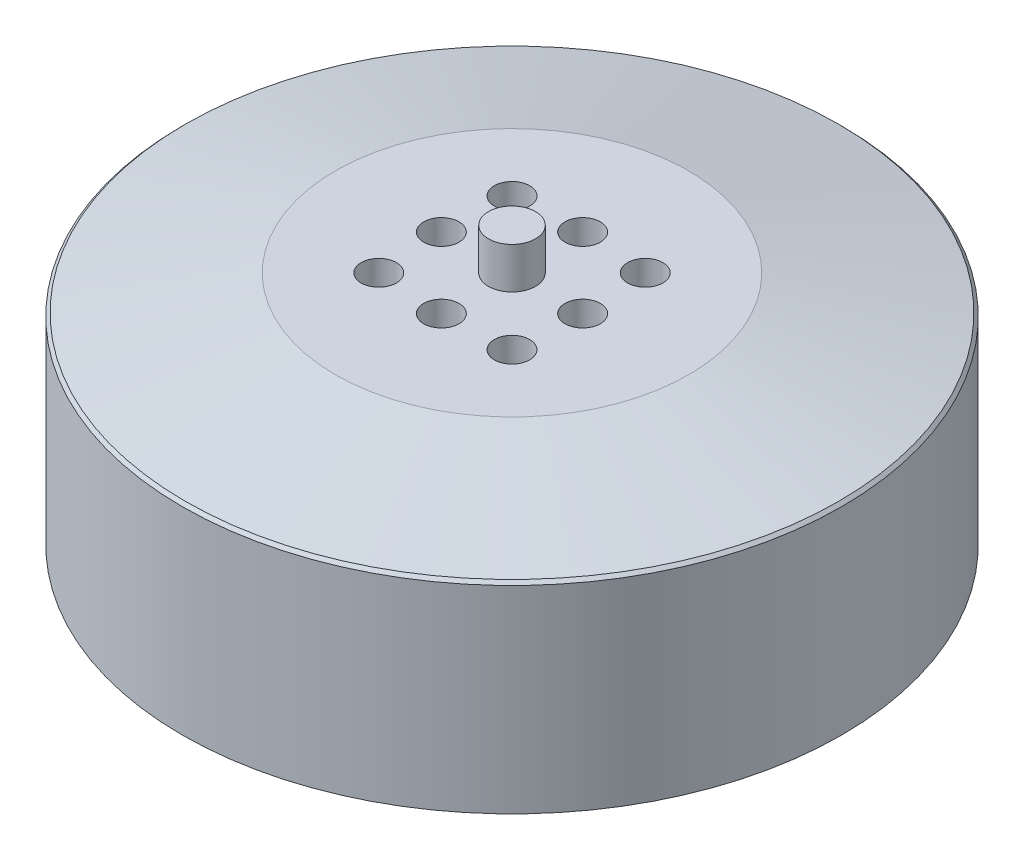
ISO-10303-21;
HEADER;
FILE_DESCRIPTION(('STEP AP214'),'2;1');
FILE_NAME('part.step','',(''),(''),'','','');
FILE_SCHEMA(('AUTOMOTIVE_DESIGN { 1 0 10303 214 1 1 1 1 }'));
ENDSEC;
DATA;
#1=APPLICATION_CONTEXT('core data for automotive mechanical design processes');
#2=APPLICATION_PROTOCOL_DEFINITION('international standard','automotive_design',2000,#1);
#3=PRODUCT_CONTEXT('',#1,'mechanical');
#4=PRODUCT('Part','Part','',(#3));
#5=PRODUCT_RELATED_PRODUCT_CATEGORY('part','',(#4));
#6=PRODUCT_DEFINITION_FORMATION('','',#4);
#7=PRODUCT_DEFINITION_CONTEXT('part definition',#1,'design');
#8=PRODUCT_DEFINITION('design','',#6,#7);
#9=PRODUCT_DEFINITION_SHAPE('','',#8);
#10=(LENGTH_UNIT() NAMED_UNIT(*) SI_UNIT(.MILLI.,.METRE.));
#11=(NAMED_UNIT(*) PLANE_ANGLE_UNIT() SI_UNIT($,.RADIAN.));
#12=(NAMED_UNIT(*) SI_UNIT($,.STERADIAN.) SOLID_ANGLE_UNIT());
#13=UNCERTAINTY_MEASURE_WITH_UNIT(LENGTH_MEASURE(1.E-05),#10,'distance_accuracy_value','');
#14=(GEOMETRIC_REPRESENTATION_CONTEXT(3) GLOBAL_UNCERTAINTY_ASSIGNED_CONTEXT((#13)) GLOBAL_UNIT_ASSIGNED_CONTEXT((#10,
#11,#12)) REPRESENTATION_CONTEXT('',''));
#15=CARTESIAN_POINT('',(0.,0.,0.));
#16=DIRECTION('',(0.,0.,1.));
#17=DIRECTION('',(1.,0.,0.));
#18=AXIS2_PLACEMENT_3D('',#15,#16,#17);
#19=CARTESIAN_POINT('',(0.,20.,0.));
#20=DIRECTION('',(0.,-1.,0.));
#21=DIRECTION('',(0.,0.,-1.));
#22=AXIS2_PLACEMENT_3D('',#19,#20,#21);
#23=CYLINDRICAL_SURFACE('',#22,28.);
#24=CARTESIAN_POINT('',(0.,16.8,0.));
#25=DIRECTION('',(0.,-1.,0.));
#26=DIRECTION('',(0.,0.,-1.));
#27=AXIS2_PLACEMENT_3D('',#24,#25,#26);
#28=CIRCLE('',#27,28.);
#29=CARTESIAN_POINT('',(0.,16.8,-28.));
#30=VERTEX_POINT('',#29);
#31=EDGE_CURVE('E10',#30,#30,#28,.T.);
#32=ORIENTED_EDGE('',*,*,#31,.T.);
#33=EDGE_LOOP('',(#32));
#34=FACE_BOUND('',#33,.T.);
#35=CARTESIAN_POINT('',(0.,0.,0.));
#36=DIRECTION('',(0.,1.,0.));
#37=DIRECTION('',(0.,0.,1.));
#38=AXIS2_PLACEMENT_3D('',#35,#36,#37);
#39=CIRCLE('',#38,28.);
#40=CARTESIAN_POINT('',(0.,0.,28.));
#41=VERTEX_POINT('',#40);
#42=EDGE_CURVE('E46',#41,#41,#39,.T.);
#43=ORIENTED_EDGE('',*,*,#42,.T.);
#44=EDGE_LOOP('',(#43));
#45=FACE_BOUND('',#44,.T.);
#46=ADVANCED_FACE('F35',(#34,#45),#23,.T.);
#47=CARTESIAN_POINT('',(0.,0.,0.));
#48=DIRECTION('',(0.,1.,0.));
#49=DIRECTION('',(0.,0.,1.));
#50=AXIS2_PLACEMENT_3D('',#47,#48,#49);
#51=PLANE('',#50);
#52=ORIENTED_EDGE('',*,*,#42,.F.);
#53=EDGE_LOOP('',(#52));
#54=FACE_BOUND('',#53,.T.);
#55=ADVANCED_FACE('F143',(#54),#51,.F.);
#56=CARTESIAN_POINT('',(0.,17.,0.));
#57=DIRECTION('',(0.,-1.,0.));
#58=DIRECTION('',(0.,0.,-1.));
#59=AXIS2_PLACEMENT_3D('',#56,#57,#58);
#60=CONICAL_SURFACE('',#59,28.,1.34399747874101);
#61=CARTESIAN_POINT('',(0.,17.06,0.));
#62=DIRECTION('',(0.,1.,0.));
#63=DIRECTION('',(0.,0.,1.));
#64=AXIS2_PLACEMENT_3D('',#61,#62,#63);
#65=CIRCLE('',#64,27.74);
#66=CARTESIAN_POINT('',(0.,17.06,27.74));
#67=VERTEX_POINT('',#66);
#68=EDGE_CURVE('E42',#67,#67,#65,.T.);
#69=ORIENTED_EDGE('',*,*,#68,.T.);
#70=EDGE_LOOP('',(#69));
#71=FACE_BOUND('',#70,.T.);
#72=CARTESIAN_POINT('',(0.,20.,0.));
#73=DIRECTION('',(0.,1.,0.));
#74=DIRECTION('',(0.,0.,1.));
#75=AXIS2_PLACEMENT_3D('',#72,#73,#74);
#76=CIRCLE('',#75,15.);
#77=CARTESIAN_POINT('',(0.,20.,15.));
#78=VERTEX_POINT('',#77);
#79=EDGE_CURVE('E50',#78,#78,#76,.T.);
#80=ORIENTED_EDGE('',*,*,#79,.F.);
#81=EDGE_LOOP('',(#80));
#82=FACE_BOUND('',#81,.T.);
#83=ADVANCED_FACE('F122',(#71,#82),#60,.T.);
#84=CARTESIAN_POINT('',(0.,20.,0.));
#85=DIRECTION('',(0.,1.,0.));
#86=DIRECTION('',(0.,0.,1.));
#87=AXIS2_PLACEMENT_3D('',#84,#85,#86);
#88=PLANE('',#87);
#89=CARTESIAN_POINT('',(5.65685424949241,20.,-5.65685424949271));
#90=DIRECTION('',(0.,1.,0.));
#91=DIRECTION('',(0.,0.,1.));
#92=AXIS2_PLACEMENT_3D('',#89,#90,#91);
#93=CIRCLE('',#92,1.5);
#94=CARTESIAN_POINT('',(5.65685424949241,20.,-4.15685424949271));
#95=VERTEX_POINT('',#94);
#96=EDGE_CURVE('E104',#95,#95,#93,.T.);
#97=ORIENTED_EDGE('',*,*,#96,.F.);
#98=EDGE_LOOP('',(#97));
#99=FACE_BOUND('',#98,.T.);
#100=CARTESIAN_POINT('',(5.65685424949271,20.,5.65685424949205));
#101=DIRECTION('',(0.,1.,0.));
#102=DIRECTION('',(0.,0.,1.));
#103=AXIS2_PLACEMENT_3D('',#100,#101,#102);
#104=CIRCLE('',#103,1.5);
#105=CARTESIAN_POINT('',(5.65685424949271,20.,7.15685424949205));
#106=VERTEX_POINT('',#105);
#107=EDGE_CURVE('E98',#106,#106,#104,.T.);
#108=ORIENTED_EDGE('',*,*,#107,.F.);
#109=EDGE_LOOP('',(#108));
#110=FACE_BOUND('',#109,.T.);
#111=CARTESIAN_POINT('',(-5.65685424949205,20.,5.65685424949235));
#112=DIRECTION('',(0.,1.,0.));
#113=DIRECTION('',(0.,0.,1.));
#114=AXIS2_PLACEMENT_3D('',#111,#112,#113);
#115=CIRCLE('',#114,1.5);
#116=CARTESIAN_POINT('',(-5.65685424949205,20.,7.15685424949235));
#117=VERTEX_POINT('',#116);
#118=EDGE_CURVE('E92',#117,#117,#115,.T.);
#119=ORIENTED_EDGE('',*,*,#118,.F.);
#120=EDGE_LOOP('',(#119));
#121=FACE_BOUND('',#120,.T.);
#122=CARTESIAN_POINT('',(-5.65685424949235,20.,-5.65685424949241));
#123=DIRECTION('',(0.,1.,0.));
#124=DIRECTION('',(0.,0.,1.));
#125=AXIS2_PLACEMENT_3D('',#122,#123,#124);
#126=CIRCLE('',#125,1.5);
#127=CARTESIAN_POINT('',(-5.65685424949235,20.,-4.15685424949241));
#128=VERTEX_POINT('',#127);
#129=EDGE_CURVE('E86',#128,#128,#126,.T.);
#130=ORIENTED_EDGE('',*,*,#129,.F.);
#131=EDGE_LOOP('',(#130));
#132=FACE_BOUND('',#131,.T.);
#133=CARTESIAN_POINT('',(6.00000000000017,20.,-1.69795468502936E-13));
#134=DIRECTION('',(0.,1.,0.));
#135=DIRECTION('',(0.,0.,1.));
#136=AXIS2_PLACEMENT_3D('',#133,#134,#135);
#137=CIRCLE('',#136,1.50000000000013);
#138=CARTESIAN_POINT('',(6.00000000000017,20.,1.49999999999996));
#139=VERTEX_POINT('',#138);
#140=EDGE_CURVE('E81',#139,#139,#137,.T.);
#141=ORIENTED_EDGE('',*,*,#140,.F.);
#142=EDGE_LOOP('',(#141));
#143=FACE_BOUND('',#142,.T.);
#144=CARTESIAN_POINT('',(3.39590937005871E-13,20.,6.));
#145=DIRECTION('',(0.,1.,0.));
#146=DIRECTION('',(0.,0.,1.));
#147=AXIS2_PLACEMENT_3D('',#144,#145,#146);
#148=CIRCLE('',#147,1.50000000000037);
#149=CARTESIAN_POINT('',(3.39590937005871E-13,20.,7.50000000000037));
#150=VERTEX_POINT('',#149);
#151=EDGE_CURVE('E75',#150,#150,#148,.T.);
#152=ORIENTED_EDGE('',*,*,#151,.F.);
#153=EDGE_LOOP('',(#152));
#154=FACE_BOUND('',#153,.T.);
#155=CARTESIAN_POINT('',(-5.99999999999983,20.,1.70530256582424E-13));
#156=DIRECTION('',(0.,1.,0.));
#157=DIRECTION('',(0.,0.,1.));
#158=AXIS2_PLACEMENT_3D('',#155,#156,#157);
#159=CIRCLE('',#158,1.50000000000027);
#160=CARTESIAN_POINT('',(-5.99999999999983,20.,1.50000000000044));
#161=VERTEX_POINT('',#160);
#162=EDGE_CURVE('E68',#161,#161,#159,.T.);
#163=ORIENTED_EDGE('',*,*,#162,.F.);
#164=EDGE_LOOP('',(#163));
#165=FACE_BOUND('',#164,.T.);
#166=CARTESIAN_POINT('',(0.,20.,-6.));
#167=DIRECTION('',(0.,1.,0.));
#168=DIRECTION('',(0.,0.,1.));
#169=AXIS2_PLACEMENT_3D('',#166,#167,#168);
#170=CIRCLE('',#169,1.5);
#171=CARTESIAN_POINT('',(0.,20.,-4.5));
#172=VERTEX_POINT('',#171);
#173=EDGE_CURVE('E62',#172,#172,#170,.T.);
#174=ORIENTED_EDGE('',*,*,#173,.F.);
#175=EDGE_LOOP('',(#174));
#176=FACE_BOUND('',#175,.T.);
#177=CARTESIAN_POINT('',(0.,20.,0.));
#178=DIRECTION('',(0.,1.,0.));
#179=DIRECTION('',(0.,0.,1.));
#180=AXIS2_PLACEMENT_3D('',#177,#178,#179);
#181=CIRCLE('',#180,2.);
#182=CARTESIAN_POINT('',(0.,20.,2.));
#183=VERTEX_POINT('',#182);
#184=EDGE_CURVE('E56',#183,#183,#181,.T.);
#185=ORIENTED_EDGE('',*,*,#184,.F.);
#186=EDGE_LOOP('',(#185));
#187=FACE_BOUND('',#186,.T.);
#188=ORIENTED_EDGE('',*,*,#79,.T.);
#189=EDGE_LOOP('',(#188));
#190=FACE_BOUND('',#189,.T.);
#191=ADVANCED_FACE('F119',(#99,#110,#121,#132,#143,#154,#165,#176,#187,#190),#88,.T.);
#192=CARTESIAN_POINT('',(0.,17.06,0.));
#193=DIRECTION('',(0.,-1.,0.));
#194=DIRECTION('',(0.,0.,-1.));
#195=AXIS2_PLACEMENT_3D('',#192,#193,#194);
#196=CONICAL_SURFACE('',#195,27.74,0.785398163397435);
#197=ORIENTED_EDGE('',*,*,#31,.F.);
#198=EDGE_LOOP('',(#197));
#199=FACE_BOUND('',#198,.T.);
#200=ORIENTED_EDGE('',*,*,#68,.F.);
#201=EDGE_LOOP('',(#200));
#202=FACE_BOUND('',#201,.T.);
#203=ADVANCED_FACE('F37',(#199,#202),#196,.T.);
#204=CARTESIAN_POINT('',(0.,23.5,0.));
#205=DIRECTION('',(0.,-1.,0.));
#206=DIRECTION('',(0.,0.,-1.));
#207=AXIS2_PLACEMENT_3D('',#204,#205,#206);
#208=CYLINDRICAL_SURFACE('',#207,2.);
#209=CARTESIAN_POINT('',(0.,23.5,0.));
#210=DIRECTION('',(0.,1.,0.));
#211=DIRECTION('',(0.,0.,1.));
#212=AXIS2_PLACEMENT_3D('',#209,#210,#211);
#213=CIRCLE('',#212,2.);
#214=CARTESIAN_POINT('',(0.,23.5,2.));
#215=VERTEX_POINT('',#214);
#216=EDGE_CURVE('E55',#215,#215,#213,.T.);
#217=ORIENTED_EDGE('',*,*,#216,.F.);
#218=EDGE_LOOP('',(#217));
#219=FACE_BOUND('',#218,.T.);
#220=ORIENTED_EDGE('',*,*,#184,.T.);
#221=EDGE_LOOP('',(#220));
#222=FACE_BOUND('',#221,.T.);
#223=ADVANCED_FACE('F180',(#219,#222),#208,.T.);
#224=CARTESIAN_POINT('',(0.,23.5,0.));
#225=DIRECTION('',(0.,1.,0.));
#226=DIRECTION('',(0.,0.,1.));
#227=AXIS2_PLACEMENT_3D('',#224,#225,#226);
#228=PLANE('',#227);
#229=ORIENTED_EDGE('',*,*,#216,.T.);
#230=EDGE_LOOP('',(#229));
#231=FACE_BOUND('',#230,.T.);
#232=ADVANCED_FACE('F189',(#231),#228,.T.);
#233=CARTESIAN_POINT('',(0.,15.,-6.));
#234=DIRECTION('',(0.,1.,0.));
#235=DIRECTION('',(0.,0.,1.));
#236=AXIS2_PLACEMENT_3D('',#233,#234,#235);
#237=CYLINDRICAL_SURFACE('',#236,1.5);
#238=CARTESIAN_POINT('',(0.,15.,-6.));
#239=DIRECTION('',(0.,1.,0.));
#240=DIRECTION('',(0.,0.,1.));
#241=AXIS2_PLACEMENT_3D('',#238,#239,#240);
#242=CIRCLE('',#241,1.5);
#243=CARTESIAN_POINT('',(0.,15.,-4.5));
#244=VERTEX_POINT('',#243);
#245=EDGE_CURVE('E59',#244,#244,#242,.T.);
#246=ORIENTED_EDGE('',*,*,#245,.F.);
#247=EDGE_LOOP('',(#246));
#248=FACE_BOUND('',#247,.T.);
#249=ORIENTED_EDGE('',*,*,#173,.T.);
#250=EDGE_LOOP('',(#249));
#251=FACE_BOUND('',#250,.T.);
#252=ADVANCED_FACE('F199',(#248,#251),#237,.F.);
#253=CARTESIAN_POINT('',(0.,15.,-6.));
#254=DIRECTION('',(0.,1.,0.));
#255=DIRECTION('',(0.,0.,1.));
#256=AXIS2_PLACEMENT_3D('',#253,#254,#255);
#257=PLANE('',#256);
#258=ORIENTED_EDGE('',*,*,#245,.T.);
#259=EDGE_LOOP('',(#258));
#260=FACE_BOUND('',#259,.T.);
#261=ADVANCED_FACE('F209',(#260),#257,.T.);
#262=CARTESIAN_POINT('',(-5.99999999999983,15.,1.70530256582424E-13));
#263=DIRECTION('',(0.,1.,0.));
#264=DIRECTION('',(0.,0.,1.));
#265=AXIS2_PLACEMENT_3D('',#262,#263,#264);
#266=CYLINDRICAL_SURFACE('',#265,1.50000000000027);
#267=CARTESIAN_POINT('',(-5.99999999999983,15.,1.70530256582424E-13));
#268=DIRECTION('',(0.,1.,0.));
#269=DIRECTION('',(0.,0.,1.));
#270=AXIS2_PLACEMENT_3D('',#267,#268,#269);
#271=CIRCLE('',#270,1.50000000000027);
#272=CARTESIAN_POINT('',(-5.99999999999983,15.,1.50000000000044));
#273=VERTEX_POINT('',#272);
#274=EDGE_CURVE('E71',#273,#273,#271,.T.);
#275=ORIENTED_EDGE('',*,*,#274,.F.);
#276=EDGE_LOOP('',(#275));
#277=FACE_BOUND('',#276,.T.);
#278=ORIENTED_EDGE('',*,*,#162,.T.);
#279=EDGE_LOOP('',(#278));
#280=FACE_BOUND('',#279,.T.);
#281=ADVANCED_FACE('F219',(#277,#280),#266,.F.);
#282=CARTESIAN_POINT('',(-5.99999999999983,15.,1.70530256582424E-13));
#283=DIRECTION('',(0.,1.,0.));
#284=DIRECTION('',(0.,0.,1.));
#285=AXIS2_PLACEMENT_3D('',#282,#283,#284);
#286=PLANE('',#285);
#287=ORIENTED_EDGE('',*,*,#274,.T.);
#288=EDGE_LOOP('',(#287));
#289=FACE_BOUND('',#288,.T.);
#290=ADVANCED_FACE('F229',(#289),#286,.T.);
#291=CARTESIAN_POINT('',(3.39590937005871E-13,15.,6.));
#292=DIRECTION('',(0.,1.,0.));
#293=DIRECTION('',(0.,0.,1.));
#294=AXIS2_PLACEMENT_3D('',#291,#292,#293);
#295=CYLINDRICAL_SURFACE('',#294,1.50000000000037);
#296=CARTESIAN_POINT('',(3.39590937005871E-13,15.,6.));
#297=DIRECTION('',(0.,1.,0.));
#298=DIRECTION('',(0.,0.,1.));
#299=AXIS2_PLACEMENT_3D('',#296,#297,#298);
#300=CIRCLE('',#299,1.50000000000037);
#301=CARTESIAN_POINT('',(3.39590937005871E-13,15.,7.50000000000037));
#302=VERTEX_POINT('',#301);
#303=EDGE_CURVE('E78',#302,#302,#300,.T.);
#304=ORIENTED_EDGE('',*,*,#303,.F.);
#305=EDGE_LOOP('',(#304));
#306=FACE_BOUND('',#305,.T.);
#307=ORIENTED_EDGE('',*,*,#151,.T.);
#308=EDGE_LOOP('',(#307));
#309=FACE_BOUND('',#308,.T.);
#310=ADVANCED_FACE('F239',(#306,#309),#295,.F.);
#311=CARTESIAN_POINT('',(3.39590937005871E-13,15.,6.));
#312=DIRECTION('',(0.,1.,0.));
#313=DIRECTION('',(0.,0.,1.));
#314=AXIS2_PLACEMENT_3D('',#311,#312,#313);
#315=PLANE('',#314);
#316=ORIENTED_EDGE('',*,*,#303,.T.);
#317=EDGE_LOOP('',(#316));
#318=FACE_BOUND('',#317,.T.);
#319=ADVANCED_FACE('F249',(#318),#315,.T.);
#320=CARTESIAN_POINT('',(6.00000000000017,15.,-1.69795468502936E-13));
#321=DIRECTION('',(0.,1.,0.));
#322=DIRECTION('',(0.,0.,1.));
#323=AXIS2_PLACEMENT_3D('',#320,#321,#322);
#324=CYLINDRICAL_SURFACE('',#323,1.50000000000013);
#325=CARTESIAN_POINT('',(6.00000000000017,15.,-1.69795468502936E-13));
#326=DIRECTION('',(0.,1.,0.));
#327=DIRECTION('',(0.,0.,1.));
#328=AXIS2_PLACEMENT_3D('',#325,#326,#327);
#329=CIRCLE('',#328,1.50000000000013);
#330=CARTESIAN_POINT('',(6.00000000000017,15.,1.49999999999996));
#331=VERTEX_POINT('',#330);
#332=EDGE_CURVE('E65',#331,#331,#329,.T.);
#333=ORIENTED_EDGE('',*,*,#332,.F.);
#334=EDGE_LOOP('',(#333));
#335=FACE_BOUND('',#334,.T.);
#336=ORIENTED_EDGE('',*,*,#140,.T.);
#337=EDGE_LOOP('',(#336));
#338=FACE_BOUND('',#337,.T.);
#339=ADVANCED_FACE('F259',(#335,#338),#324,.F.);
#340=CARTESIAN_POINT('',(6.00000000000017,15.,-1.69795468502936E-13));
#341=DIRECTION('',(0.,1.,0.));
#342=DIRECTION('',(0.,0.,1.));
#343=AXIS2_PLACEMENT_3D('',#340,#341,#342);
#344=PLANE('',#343);
#345=ORIENTED_EDGE('',*,*,#332,.T.);
#346=EDGE_LOOP('',(#345));
#347=FACE_BOUND('',#346,.T.);
#348=ADVANCED_FACE('F269',(#347),#344,.T.);
#349=CARTESIAN_POINT('',(-5.65685424949235,10.,-5.65685424949241));
#350=DIRECTION('',(0.,1.,0.));
#351=DIRECTION('',(0.,0.,1.));
#352=AXIS2_PLACEMENT_3D('',#349,#350,#351);
#353=CYLINDRICAL_SURFACE('',#352,1.5);
#354=CARTESIAN_POINT('',(-5.65685424949235,10.,-5.65685424949241));
#355=DIRECTION('',(0.,1.,0.));
#356=DIRECTION('',(0.,0.,1.));
#357=AXIS2_PLACEMENT_3D('',#354,#355,#356);
#358=CIRCLE('',#357,1.5);
#359=CARTESIAN_POINT('',(-5.65685424949235,10.,-4.15685424949241));
#360=VERTEX_POINT('',#359);
#361=EDGE_CURVE('E72',#360,#360,#358,.T.);
#362=ORIENTED_EDGE('',*,*,#361,.F.);
#363=EDGE_LOOP('',(#362));
#364=FACE_BOUND('',#363,.T.);
#365=ORIENTED_EDGE('',*,*,#129,.T.);
#366=EDGE_LOOP('',(#365));
#367=FACE_BOUND('',#366,.T.);
#368=ADVANCED_FACE('F278',(#364,#367),#353,.F.);
#369=CARTESIAN_POINT('',(-5.65685424949235,10.,-5.65685424949241));
#370=DIRECTION('',(0.,1.,0.));
#371=DIRECTION('',(0.,0.,1.));
#372=AXIS2_PLACEMENT_3D('',#369,#370,#371);
#373=PLANE('',#372);
#374=ORIENTED_EDGE('',*,*,#361,.T.);
#375=EDGE_LOOP('',(#374));
#376=FACE_BOUND('',#375,.T.);
#377=ADVANCED_FACE('F291',(#376),#373,.T.);
#378=CARTESIAN_POINT('',(-5.65685424949205,10.,5.65685424949235));
#379=DIRECTION('',(0.,1.,0.));
#380=DIRECTION('',(0.,0.,1.));
#381=AXIS2_PLACEMENT_3D('',#378,#379,#380);
#382=CYLINDRICAL_SURFACE('',#381,1.5);
#383=CARTESIAN_POINT('',(-5.65685424949205,10.,5.65685424949235));
#384=DIRECTION('',(0.,1.,0.));
#385=DIRECTION('',(0.,0.,1.));
#386=AXIS2_PLACEMENT_3D('',#383,#384,#385);
#387=CIRCLE('',#386,1.5);
#388=CARTESIAN_POINT('',(-5.65685424949205,10.,7.15685424949235));
#389=VERTEX_POINT('',#388);
#390=EDGE_CURVE('E95',#389,#389,#387,.T.);
#391=ORIENTED_EDGE('',*,*,#390,.F.);
#392=EDGE_LOOP('',(#391));
#393=FACE_BOUND('',#392,.T.);
#394=ORIENTED_EDGE('',*,*,#118,.T.);
#395=EDGE_LOOP('',(#394));
#396=FACE_BOUND('',#395,.T.);
#397=ADVANCED_FACE('F301',(#393,#396),#382,.F.);
#398=CARTESIAN_POINT('',(-5.65685424949205,10.,5.65685424949235));
#399=DIRECTION('',(0.,1.,0.));
#400=DIRECTION('',(0.,0.,1.));
#401=AXIS2_PLACEMENT_3D('',#398,#399,#400);
#402=PLANE('',#401);
#403=ORIENTED_EDGE('',*,*,#390,.T.);
#404=EDGE_LOOP('',(#403));
#405=FACE_BOUND('',#404,.T.);
#406=ADVANCED_FACE('F311',(#405),#402,.T.);
#407=CARTESIAN_POINT('',(5.65685424949271,10.,5.65685424949205));
#408=DIRECTION('',(0.,1.,0.));
#409=DIRECTION('',(0.,0.,1.));
#410=AXIS2_PLACEMENT_3D('',#407,#408,#409);
#411=CYLINDRICAL_SURFACE('',#410,1.5);
#412=CARTESIAN_POINT('',(5.65685424949271,10.,5.65685424949205));
#413=DIRECTION('',(0.,1.,0.));
#414=DIRECTION('',(0.,0.,1.));
#415=AXIS2_PLACEMENT_3D('',#412,#413,#414);
#416=CIRCLE('',#415,1.5);
#417=CARTESIAN_POINT('',(5.65685424949271,10.,7.15685424949205));
#418=VERTEX_POINT('',#417);
#419=EDGE_CURVE('E101',#418,#418,#416,.T.);
#420=ORIENTED_EDGE('',*,*,#419,.F.);
#421=EDGE_LOOP('',(#420));
#422=FACE_BOUND('',#421,.T.);
#423=ORIENTED_EDGE('',*,*,#107,.T.);
#424=EDGE_LOOP('',(#423));
#425=FACE_BOUND('',#424,.T.);
#426=ADVANCED_FACE('F321',(#422,#425),#411,.F.);
#427=CARTESIAN_POINT('',(5.65685424949271,10.,5.65685424949205));
#428=DIRECTION('',(0.,1.,0.));
#429=DIRECTION('',(0.,0.,1.));
#430=AXIS2_PLACEMENT_3D('',#427,#428,#429);
#431=PLANE('',#430);
#432=ORIENTED_EDGE('',*,*,#419,.T.);
#433=EDGE_LOOP('',(#432));
#434=FACE_BOUND('',#433,.T.);
#435=ADVANCED_FACE('F115',(#434),#431,.T.);
#436=CARTESIAN_POINT('',(5.65685424949241,10.,-5.65685424949271));
#437=DIRECTION('',(0.,1.,0.));
#438=DIRECTION('',(0.,0.,1.));
#439=AXIS2_PLACEMENT_3D('',#436,#437,#438);
#440=CYLINDRICAL_SURFACE('',#439,1.5);
#441=CARTESIAN_POINT('',(5.65685424949241,10.,-5.65685424949271));
#442=DIRECTION('',(0.,1.,0.));
#443=DIRECTION('',(0.,0.,1.));
#444=AXIS2_PLACEMENT_3D('',#441,#442,#443);
#445=CIRCLE('',#444,1.5);
#446=CARTESIAN_POINT('',(5.65685424949241,10.,-4.15685424949271));
#447=VERTEX_POINT('',#446);
#448=EDGE_CURVE('E89',#447,#447,#445,.T.);
#449=ORIENTED_EDGE('',*,*,#448,.F.);
#450=EDGE_LOOP('',(#449));
#451=FACE_BOUND('',#450,.T.);
#452=ORIENTED_EDGE('',*,*,#96,.T.);
#453=EDGE_LOOP('',(#452));
#454=FACE_BOUND('',#453,.T.);
#455=ADVANCED_FACE('F112',(#451,#454),#440,.F.);
#456=CARTESIAN_POINT('',(5.65685424949241,10.,-5.65685424949271));
#457=DIRECTION('',(0.,1.,0.));
#458=DIRECTION('',(0.,0.,1.));
#459=AXIS2_PLACEMENT_3D('',#456,#457,#458);
#460=PLANE('',#459);
#461=ORIENTED_EDGE('',*,*,#448,.T.);
#462=EDGE_LOOP('',(#461));
#463=FACE_BOUND('',#462,.T.);
#464=ADVANCED_FACE('F110',(#463),#460,.T.);
#465=CLOSED_SHELL('',(#46,#55,#83,#191,#203,#223,#232,#252,#261,#281,#290,#310,#319,#339,#348,
#368,#377,#397,#406,#426,#435,#455,#464));
#466=MANIFOLD_SOLID_BREP('B2',#465);
#467=ADVANCED_BREP_SHAPE_REPRESENTATION('',(#18,#466),#14);
#468=SHAPE_DEFINITION_REPRESENTATION(#9,#467);
ENDSEC;
END-ISO-10303-21;
